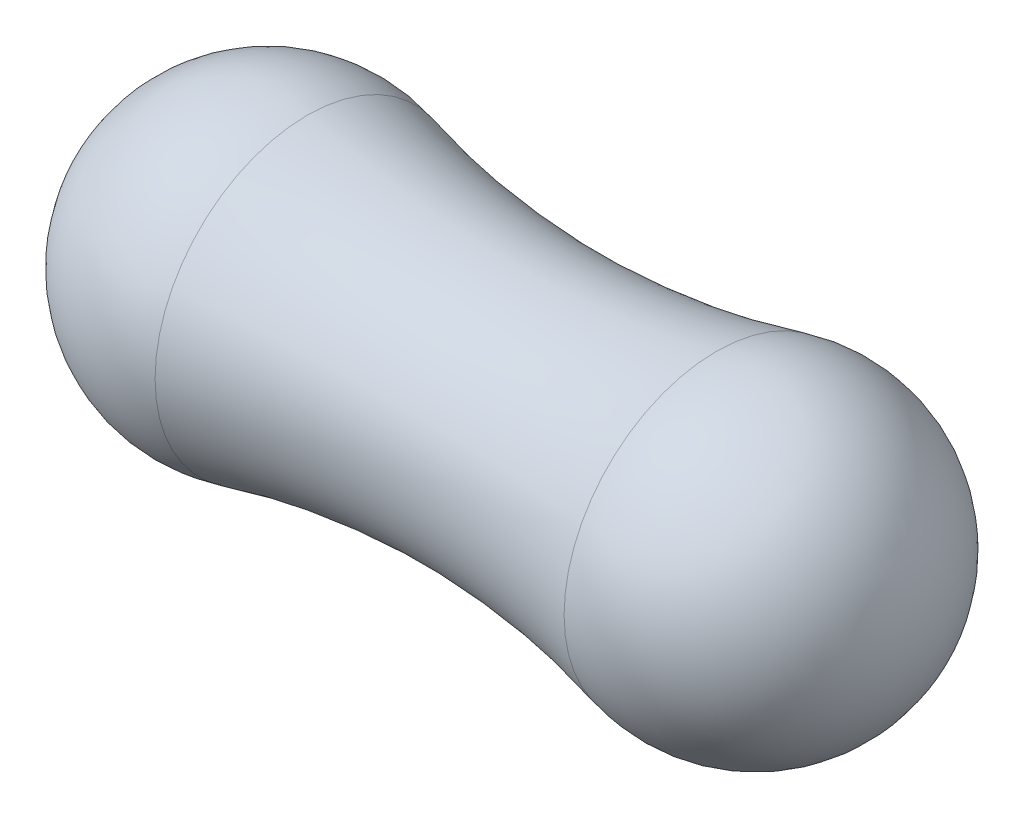
ISO-10303-21;
HEADER;
FILE_DESCRIPTION(('STEP AP214'),'2;1');
FILE_NAME('part.step','',(''),(''),'','','');
FILE_SCHEMA(('AUTOMOTIVE_DESIGN { 1 0 10303 214 1 1 1 1 }'));
ENDSEC;
DATA;
#1=APPLICATION_CONTEXT('core data for automotive mechanical design processes');
#2=APPLICATION_PROTOCOL_DEFINITION('international standard','automotive_design',2000,#1);
#3=PRODUCT_CONTEXT('',#1,'mechanical');
#4=PRODUCT('Part','Part','',(#3));
#5=PRODUCT_RELATED_PRODUCT_CATEGORY('part','',(#4));
#6=PRODUCT_DEFINITION_FORMATION('','',#4);
#7=PRODUCT_DEFINITION_CONTEXT('part definition',#1,'design');
#8=PRODUCT_DEFINITION('design','',#6,#7);
#9=PRODUCT_DEFINITION_SHAPE('','',#8);
#10=(LENGTH_UNIT() NAMED_UNIT(*) SI_UNIT(.MILLI.,.METRE.));
#11=(NAMED_UNIT(*) PLANE_ANGLE_UNIT() SI_UNIT($,.RADIAN.));
#12=(NAMED_UNIT(*) SI_UNIT($,.STERADIAN.) SOLID_ANGLE_UNIT());
#13=UNCERTAINTY_MEASURE_WITH_UNIT(LENGTH_MEASURE(1.E-05),#10,'distance_accuracy_value','');
#14=(GEOMETRIC_REPRESENTATION_CONTEXT(3) GLOBAL_UNCERTAINTY_ASSIGNED_CONTEXT((#13)) GLOBAL_UNIT_ASSIGNED_CONTEXT((#10,
#11,#12)) REPRESENTATION_CONTEXT('',''));
#15=CARTESIAN_POINT('',(0.,0.,0.));
#16=DIRECTION('',(0.,0.,1.));
#17=DIRECTION('',(1.,0.,0.));
#18=AXIS2_PLACEMENT_3D('',#15,#16,#17);
#19=CARTESIAN_POINT('',(-1.54448271237891,0.,0.));
#20=DIRECTION('',(-1.,0.,0.));
#21=DIRECTION('',(0.,0.,-1.));
#22=AXIS2_PLACEMENT_3D('',#19,#20,#21);
#23=SPHERICAL_SURFACE('',#22,0.995517287621086);
#24=CARTESIAN_POINT('',(-1.29495870392393,0.,0.));
#25=DIRECTION('',(-1.,0.,0.));
#26=DIRECTION('',(0.,0.,1.));
#27=AXIS2_PLACEMENT_3D('',#24,#25,#26);
#28=CIRCLE('',#27,0.963738781598518);
#29=CARTESIAN_POINT('',(-1.29495870392393,0.,0.963738781598515));
#30=VERTEX_POINT('',#29);
#31=EDGE_CURVE('E10',#30,#30,#28,.T.);
#32=ORIENTED_EDGE('',*,*,#31,.T.);
#33=EDGE_LOOP('',(#32));
#34=FACE_BOUND('',#33,.T.);
#35=ADVANCED_FACE('F29',(#34),#23,.T.);
#36=CARTESIAN_POINT('',(0.,0.,0.));
#37=DIRECTION('',(-1.,0.,0.));
#38=DIRECTION('',(0.,0.,1.));
#39=AXIS2_PLACEMENT_3D('',#36,#37,#38);
#40=TOROIDAL_SURFACE('',#39,5.96526922056302,5.16645185565072);
#41=ORIENTED_EDGE('',*,*,#31,.F.);
#42=EDGE_LOOP('',(#41));
#43=FACE_BOUND('',#42,.T.);
#44=CARTESIAN_POINT('',(1.29495870392393,0.,0.));
#45=DIRECTION('',(-1.,0.,0.));
#46=DIRECTION('',(0.,0.,1.));
#47=AXIS2_PLACEMENT_3D('',#44,#45,#46);
#48=CIRCLE('',#47,0.963738781598519);
#49=CARTESIAN_POINT('',(1.29495870392393,0.,0.963738781598517));
#50=VERTEX_POINT('',#49);
#51=EDGE_CURVE('E35',#50,#50,#48,.T.);
#52=ORIENTED_EDGE('',*,*,#51,.T.);
#53=EDGE_LOOP('',(#52));
#54=FACE_BOUND('',#53,.T.);
#55=ADVANCED_FACE('F41',(#43,#54),#40,.F.);
#56=CARTESIAN_POINT('',(1.54448271237891,0.,0.));
#57=DIRECTION('',(-1.,0.,0.));
#58=DIRECTION('',(0.,0.,-1.));
#59=AXIS2_PLACEMENT_3D('',#56,#57,#58);
#60=SPHERICAL_SURFACE('',#59,0.995517287621086);
#61=ORIENTED_EDGE('',*,*,#51,.F.);
#62=EDGE_LOOP('',(#61));
#63=FACE_BOUND('',#62,.T.);
#64=ADVANCED_FACE('F43',(#63),#60,.T.);
#65=CLOSED_SHELL('',(#35,#55,#64));
#66=MANIFOLD_SOLID_BREP('B2',#65);
#67=ADVANCED_BREP_SHAPE_REPRESENTATION('',(#18,#66),#14);
#68=SHAPE_DEFINITION_REPRESENTATION(#9,#67);
ENDSEC;
END-ISO-10303-21;
